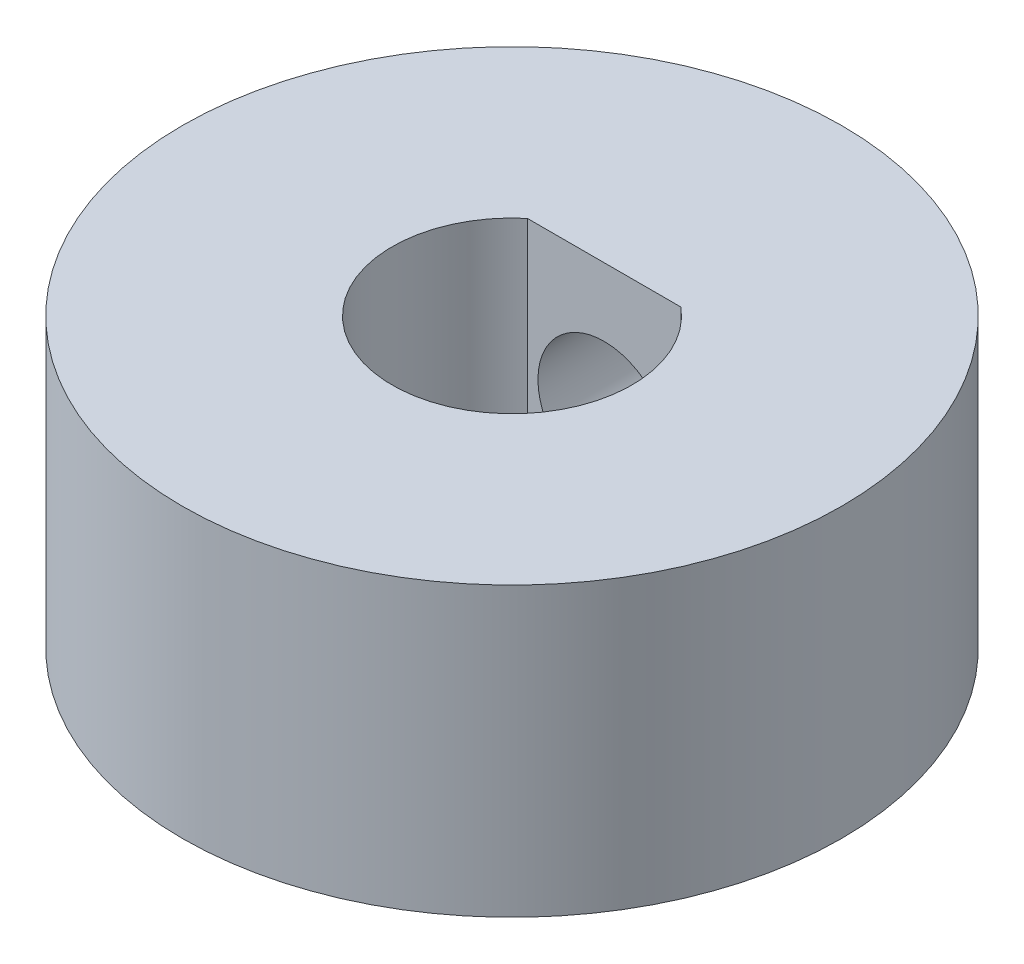
ISO-10303-21;
HEADER;
FILE_DESCRIPTION(('STEP AP214'),'2;1');
FILE_NAME('part.step','',(''),(''),'','','');
FILE_SCHEMA(('AUTOMOTIVE_DESIGN { 1 0 10303 214 1 1 1 1 }'));
ENDSEC;
DATA;
#1=APPLICATION_CONTEXT('core data for automotive mechanical design processes');
#2=APPLICATION_PROTOCOL_DEFINITION('international standard','automotive_design',2000,#1);
#3=PRODUCT_CONTEXT('',#1,'mechanical');
#4=PRODUCT('Part','Part','',(#3));
#5=PRODUCT_RELATED_PRODUCT_CATEGORY('part','',(#4));
#6=PRODUCT_DEFINITION_FORMATION('','',#4);
#7=PRODUCT_DEFINITION_CONTEXT('part definition',#1,'design');
#8=PRODUCT_DEFINITION('design','',#6,#7);
#9=PRODUCT_DEFINITION_SHAPE('','',#8);
#10=(LENGTH_UNIT() NAMED_UNIT(*) SI_UNIT(.MILLI.,.METRE.));
#11=(NAMED_UNIT(*) PLANE_ANGLE_UNIT() SI_UNIT($,.RADIAN.));
#12=(NAMED_UNIT(*) SI_UNIT($,.STERADIAN.) SOLID_ANGLE_UNIT());
#13=UNCERTAINTY_MEASURE_WITH_UNIT(LENGTH_MEASURE(1.E-05),#10,'distance_accuracy_value','');
#14=(GEOMETRIC_REPRESENTATION_CONTEXT(3) GLOBAL_UNCERTAINTY_ASSIGNED_CONTEXT((#13)) GLOBAL_UNIT_ASSIGNED_CONTEXT((#10,
#11,#12)) REPRESENTATION_CONTEXT('',''));
#15=CARTESIAN_POINT('',(0.,0.,0.));
#16=DIRECTION('',(0.,0.,1.));
#17=DIRECTION('',(1.,0.,0.));
#18=AXIS2_PLACEMENT_3D('',#15,#16,#17);
#19=CARTESIAN_POINT('',(0.,7.62,0.));
#20=DIRECTION('',(0.,-1.,0.));
#21=DIRECTION('',(0.,0.,-1.));
#22=AXIS2_PLACEMENT_3D('',#19,#20,#21);
#23=CYLINDRICAL_SURFACE('',#22,3.175);
#24=CARTESIAN_POINT('',(0.,0.,0.));
#25=DIRECTION('',(0.,1.,0.));
#26=DIRECTION('',(0.,0.,1.));
#27=AXIS2_PLACEMENT_3D('',#24,#25,#26);
#28=CIRCLE('',#27,3.175);
#29=CARTESIAN_POINT('',(-2.032,0.,-2.43959033446192));
#30=VERTEX_POINT('',#29);
#31=CARTESIAN_POINT('',(2.032,0.,-2.43959033446192));
#32=VERTEX_POINT('',#31);
#33=EDGE_CURVE('E73',#30,#32,#28,.T.);
#34=ORIENTED_EDGE('',*,*,#33,.F.);
#35=DIRECTION('',(0.,-1.,0.));
#36=VECTOR('',#35,1.);
#37=CARTESIAN_POINT('',(-2.032,7.62,-2.43959033446192));
#38=LINE('',#37,#36);
#39=CARTESIAN_POINT('',(-2.032,7.62,-2.43959033446192));
#40=VERTEX_POINT('',#39);
#41=EDGE_CURVE('E51',#40,#30,#38,.T.);
#42=ORIENTED_EDGE('',*,*,#41,.F.);
#43=CARTESIAN_POINT('',(0.,7.62,0.));
#44=DIRECTION('',(0.,1.,0.));
#45=DIRECTION('',(0.,0.,1.));
#46=AXIS2_PLACEMENT_3D('',#43,#44,#45);
#47=CIRCLE('',#46,3.175);
#48=CARTESIAN_POINT('',(2.032,7.62,-2.43959033446192));
#49=VERTEX_POINT('',#48);
#50=EDGE_CURVE('E74',#40,#49,#47,.T.);
#51=ORIENTED_EDGE('',*,*,#50,.T.);
#52=DIRECTION('',(0.,-1.,0.));
#53=VECTOR('',#52,1.);
#54=CARTESIAN_POINT('',(2.032,7.62,-2.43959033446192));
#55=LINE('',#54,#53);
#56=EDGE_CURVE('E71',#49,#32,#55,.T.);
#57=ORIENTED_EDGE('',*,*,#56,.T.);
#58=EDGE_LOOP('',(#34,#42,#51,#57));
#59=FACE_BOUND('',#58,.T.);
#60=ADVANCED_FACE('F38',(#59),#23,.F.);
#61=CARTESIAN_POINT('',(0.,7.62,-2.43959033446192));
#62=DIRECTION('',(0.,0.,-1.));
#63=DIRECTION('',(-1.,0.,0.));
#64=AXIS2_PLACEMENT_3D('',#61,#62,#63);
#65=PLANE('',#64);
#66=CARTESIAN_POINT('',(0.,4.064,-2.43959033446191));
#67=DIRECTION('',(0.,0.,-1.));
#68=DIRECTION('',(-1.,0.,0.));
#69=AXIS2_PLACEMENT_3D('',#66,#67,#68);
#70=CIRCLE('',#69,1.7526);
#71=CARTESIAN_POINT('',(-1.7526,4.064,-2.43959033446191));
#72=VERTEX_POINT('',#71);
#73=EDGE_CURVE('E87',#72,#72,#70,.F.);
#74=ORIENTED_EDGE('',*,*,#73,.F.);
#75=EDGE_LOOP('',(#74));
#76=FACE_BOUND('',#75,.T.);
#77=DIRECTION('',(1.,0.,0.));
#78=VECTOR('',#77,1.);
#79=CARTESIAN_POINT('',(0.,0.,-2.43959033446192));
#80=LINE('',#79,#78);
#81=EDGE_CURVE('E77',#30,#32,#80,.T.);
#82=ORIENTED_EDGE('',*,*,#81,.T.);
#83=ORIENTED_EDGE('',*,*,#56,.F.);
#84=DIRECTION('',(1.,0.,0.));
#85=VECTOR('',#84,1.);
#86=CARTESIAN_POINT('',(0.,7.62,-2.43959033446192));
#87=LINE('',#86,#85);
#88=EDGE_CURVE('E58',#40,#49,#87,.T.);
#89=ORIENTED_EDGE('',*,*,#88,.F.);
#90=ORIENTED_EDGE('',*,*,#41,.T.);
#91=EDGE_LOOP('',(#82,#83,#89,#90));
#92=FACE_BOUND('',#91,.T.);
#93=ADVANCED_FACE('F78',(#76,#92),#65,.F.);
#94=CARTESIAN_POINT('',(0.,7.62,0.));
#95=DIRECTION('',(0.,-1.,0.));
#96=DIRECTION('',(0.,0.,-1.));
#97=AXIS2_PLACEMENT_3D('',#94,#95,#96);
#98=CYLINDRICAL_SURFACE('',#97,8.73125);
#99=CARTESIAN_POINT('',(0.,6.8326,-8.73125));
#100=CARTESIAN_POINT('',(-0.151472384584233,6.83259935298434,-8.73124947449106));
#101=CARTESIAN_POINT('',(-0.3029520113905,6.82012837544081,-8.72727129269476));
#102=CARTESIAN_POINT('',(-0.601474430383907,6.77070940866285,-8.71179172891819));
#103=CARTESIAN_POINT('',(-0.748516330870155,6.73375653391253,-8.70028884534234));
#104=CARTESIAN_POINT('',(-1.0338156844574,6.63675016258388,-8.67101504432199));
#105=CARTESIAN_POINT('',(-1.17208657407177,6.576733045639,-8.65325400163016));
#106=CARTESIAN_POINT('',(-1.4366017145973,6.43545872542401,-8.61329318281153));
#107=CARTESIAN_POINT('',(-1.56284395859653,6.35419798621246,-8.59109266789175));
#108=CARTESIAN_POINT('',(-1.80372047067413,6.17003289918125,-8.54381798243644));
#109=CARTESIAN_POINT('',(-1.91792010208838,6.06657656530013,-8.51867983669334));
#110=CARTESIAN_POINT('',(-2.12767343767985,5.84213193357004,-8.46872959414002));
#111=CARTESIAN_POINT('',(-2.2232235392977,5.72114025624111,-8.44391756118718));
#112=CARTESIAN_POINT('',(-2.39534876748479,5.46126454367839,-8.39673867205372));
#113=CARTESIAN_POINT('',(-2.47137620234697,5.32200209421514,-8.37445056621347));
#114=CARTESIAN_POINT('',(-2.59874998873783,5.03184701475919,-8.33580756098609));
#115=CARTESIAN_POINT('',(-2.65010306105726,4.88095756473137,-8.31945104625312));
#116=CARTESIAN_POINT('',(-2.72507133844266,4.57674478071945,-8.29519330661295));
#117=CARTESIAN_POINT('',(-2.74949460363218,4.42364072089239,-8.28704643290134));
#118=CARTESIAN_POINT('',(-2.77243486132888,4.11530797622602,-8.27940162413595));
#119=CARTESIAN_POINT('',(-2.77095897618445,3.96007988723457,-8.27990131125003));
#120=CARTESIAN_POINT('',(-2.74277384122496,3.65863343886841,-8.28927666852696));
#121=CARTESIAN_POINT('',(-2.71709756240168,3.51230602485856,-8.2978094371684));
#122=CARTESIAN_POINT('',(-2.64291753019867,3.22615374592841,-8.32173160663915));
#123=CARTESIAN_POINT('',(-2.59441128518325,3.08632959259704,-8.33712175586515));
#124=CARTESIAN_POINT('',(-2.47523037707125,2.81471682139735,-8.37328338181039));
#125=CARTESIAN_POINT('',(-2.40423533028052,2.68307947211083,-8.39413182382158));
#126=CARTESIAN_POINT('',(-2.24231457480099,2.43325025607457,-8.43882633045629));
#127=CARTESIAN_POINT('',(-2.15138356095298,2.3150619809983,-8.46267319226737));
#128=CARTESIAN_POINT('',(-1.94712641847256,2.08965345989879,-8.51204751992886));
#129=CARTESIAN_POINT('',(-1.83294927818404,1.98320868631123,-8.53760132442253));
#130=CARTESIAN_POINT('',(-1.5880475571794,1.79078574495724,-8.58652454816324));
#131=CARTESIAN_POINT('',(-1.4573216781893,1.70480918447965,-8.60989379577812));
#132=CARTESIAN_POINT('',(-1.1815066053666,1.5552168410868,-8.6520728477574));
#133=CARTESIAN_POINT('',(-1.03630805468641,1.49179091316723,-8.67084354454731));
#134=CARTESIAN_POINT('',(-0.736567856371046,1.39049704215195,-8.7014279616364));
#135=CARTESIAN_POINT('',(-0.582029149746095,1.35262109914003,-8.71324385939411));
#136=CARTESIAN_POINT('',(-0.274574060893411,1.30483468402359,-8.72823473184806));
#137=CARTESIAN_POINT('',(-0.121836344071211,1.29387484025335,-8.73173376976));
#138=CARTESIAN_POINT('',(0.183314914836963,1.29726646301027,-8.73065800910595));
#139=CARTESIAN_POINT('',(0.335728502364473,1.31161411017102,-8.72608442884663));
#140=CARTESIAN_POINT('',(0.631824679178514,1.36437346823906,-8.70959051257118));
#141=CARTESIAN_POINT('',(0.775631013443132,1.40215653444254,-8.69786222963305));
#142=CARTESIAN_POINT('',(1.05481947051424,1.49994307731108,-8.66843724040155));
#143=CARTESIAN_POINT('',(1.19020054164173,1.55994932150041,-8.65073979077305));
#144=CARTESIAN_POINT('',(1.4524347312682,1.7021410842905,-8.61064475376114));
#145=CARTESIAN_POINT('',(1.57899276968752,1.78484014831072,-8.588141406858));
#146=CARTESIAN_POINT('',(1.81678475390539,1.9694567459568,-8.54100338427114));
#147=CARTESIAN_POINT('',(1.9280144126383,2.07137963733053,-8.51636811545168));
#148=CARTESIAN_POINT('',(2.1367142462555,2.29648711494163,-8.4664734297526));
#149=CARTESIAN_POINT('',(2.23343617915372,2.42037047486329,-8.44122965963221));
#150=CARTESIAN_POINT('',(2.4047910332809,2.68315731234719,-8.39402366718418));
#151=CARTESIAN_POINT('',(2.47942420498251,2.82206061956828,-8.37206140764768));
#152=CARTESIAN_POINT('',(2.60404062267292,3.11072422716668,-8.33414377062547));
#153=CARTESIAN_POINT('',(2.65411076479825,3.26044407288566,-8.31816726556818));
#154=CARTESIAN_POINT('',(2.72814027283026,3.56680321246625,-8.29418596912205));
#155=CARTESIAN_POINT('',(2.75210995727697,3.72343974638568,-8.28617802755383));
#156=CARTESIAN_POINT('',(2.77250292470933,4.03134505258087,-8.27937538147864));
#157=CARTESIAN_POINT('',(2.77015671446854,4.18252421917552,-8.28016909910884));
#158=CARTESIAN_POINT('',(2.74096747215079,4.48221970476836,-8.2898766597354));
#159=CARTESIAN_POINT('',(2.71412564708891,4.63073615460356,-8.29879010263436));
#160=CARTESIAN_POINT('',(2.63754140234477,4.91861837349535,-8.32344101159602));
#161=CARTESIAN_POINT('',(2.58816103947087,5.05809042121644,-8.33907036972361));
#162=CARTESIAN_POINT('',(2.46818810716033,5.32688036990157,-8.37536170452968));
#163=CARTESIAN_POINT('',(2.39759113260101,5.45619615512055,-8.39602472615923));
#164=CARTESIAN_POINT('',(2.23387835420621,5.70661995387902,-8.44108922352175));
#165=CARTESIAN_POINT('',(2.13997279679889,5.82719059799191,-8.46560741814809));
#166=CARTESIAN_POINT('',(1.93368630683579,6.05126075511337,-8.51509362004053));
#167=CARTESIAN_POINT('',(1.82130037389265,6.15475563256535,-8.54006174741605));
#168=CARTESIAN_POINT('',(1.57665069072115,6.34526205813802,-8.58865246257704));
#169=CARTESIAN_POINT('',(1.44384128482807,6.43159405567302,-8.61220050648618));
#170=CARTESIAN_POINT('',(1.16484980429616,6.58059622072828,-8.65434625576332));
#171=CARTESIAN_POINT('',(1.018672625294,6.64327500791705,-8.67294576373933));
#172=CARTESIAN_POINT('',(0.72856186729587,6.73904703416671,-8.7019271673855));
#173=CARTESIAN_POINT('',(0.585301340574924,6.77402598526938,-8.71282596740998));
#174=CARTESIAN_POINT('',(0.294695565068272,6.82080026865578,-8.72748686535895));
#175=CARTESIAN_POINT('',(0.147351209283364,6.83260062941202,-8.73125051121119));
#176=CARTESIAN_POINT('',(0.,6.8326,-8.73125));
#177=B_SPLINE_CURVE_WITH_KNOTS('',3,(#99,#100,#101,#102,#103,#104,#105,#106,#107,#108,#109,#110,
#111,#112,#113,#114,#115,#116,#117,#118,#119,#120,#121,#122,#123,#124,#125,#126,#127,#128,#129,
#130,#131,#132,#133,#134,#135,#136,#137,#138,#139,#140,#141,#142,#143,#144,#145,#146,#147,#148,
#149,#150,#151,#152,#153,#154,#155,#156,#157,#158,#159,#160,#161,#162,#163,#164,#165,#166,#167,
#168,#169,#170,#171,#172,#173,#174,#175,#176),.UNSPECIFIED.,.T.,.F.,(4,2,2,2,2,2,2,2,2,2,2,2,2,
2,2,2,2,2,2,2,2,2,2,2,2,2,2,2,2,2,2,2,2,2,2,2,2,2,4),(0.,0.453875402871957,0.907841406715232,
1.36109428167842,1.81442264740051,2.28070145331589,2.74707024209938,3.22536463900073,
3.70352868435285,4.16691760762408,4.63017909947097,5.07452138042134,5.51891216761527,
5.96994245980804,6.42109292164611,6.8934249132351,7.3657939829856,7.84205069695993,
8.31815822163036,8.77538643564025,9.23254565139696,9.67794257103017,10.1233949760448,
10.5799040113177,11.0365404657625,11.5118416234337,11.9871373912826,12.4607393666331,
12.9341540403948,13.3855282360861,13.8368801916315,14.2812238524466,14.7256598344222,
15.1879247961639,15.6503150431813,16.1284162822251,16.6063431236748,17.0479655585333,
17.4894921751553),.UNSPECIFIED.);
#178=CARTESIAN_POINT('',(0.,6.8326,-8.73125));
#179=VERTEX_POINT('',#178);
#180=EDGE_CURVE('E11',#179,#179,#177,.T.);
#181=ORIENTED_EDGE('',*,*,#180,.T.);
#182=EDGE_LOOP('',(#181));
#183=FACE_BOUND('',#182,.T.);
#184=CARTESIAN_POINT('',(0.,7.62,0.));
#185=DIRECTION('',(0.,1.,0.));
#186=DIRECTION('',(0.,0.,1.));
#187=AXIS2_PLACEMENT_3D('',#184,#185,#186);
#188=CIRCLE('',#187,8.73125);
#189=CARTESIAN_POINT('',(0.,7.62,8.73125));
#190=VERTEX_POINT('',#189);
#191=EDGE_CURVE('E75',#190,#190,#188,.T.);
#192=ORIENTED_EDGE('',*,*,#191,.F.);
#193=EDGE_LOOP('',(#192));
#194=FACE_BOUND('',#193,.T.);
#195=CARTESIAN_POINT('',(0.,0.,0.));
#196=DIRECTION('',(0.,1.,0.));
#197=DIRECTION('',(0.,0.,1.));
#198=AXIS2_PLACEMENT_3D('',#195,#196,#197);
#199=CIRCLE('',#198,8.73125);
#200=CARTESIAN_POINT('',(0.,0.,8.73125));
#201=VERTEX_POINT('',#200);
#202=EDGE_CURVE('E80',#201,#201,#199,.T.);
#203=ORIENTED_EDGE('',*,*,#202,.T.);
#204=EDGE_LOOP('',(#203));
#205=FACE_BOUND('',#204,.T.);
#206=ADVANCED_FACE('F106',(#183,#194,#205),#98,.T.);
#207=CARTESIAN_POINT('',(0.,7.62,0.));
#208=DIRECTION('',(0.,1.,0.));
#209=DIRECTION('',(0.,0.,1.));
#210=AXIS2_PLACEMENT_3D('',#207,#208,#209);
#211=PLANE('',#210);
#212=ORIENTED_EDGE('',*,*,#50,.F.);
#213=ORIENTED_EDGE('',*,*,#88,.T.);
#214=EDGE_LOOP('',(#212,#213));
#215=FACE_BOUND('',#214,.T.);
#216=ORIENTED_EDGE('',*,*,#191,.T.);
#217=EDGE_LOOP('',(#216));
#218=FACE_BOUND('',#217,.T.);
#219=ADVANCED_FACE('F111',(#215,#218),#211,.T.);
#220=CARTESIAN_POINT('',(0.,0.,0.));
#221=DIRECTION('',(0.,1.,0.));
#222=DIRECTION('',(0.,0.,1.));
#223=AXIS2_PLACEMENT_3D('',#220,#221,#222);
#224=PLANE('',#223);
#225=ORIENTED_EDGE('',*,*,#33,.T.);
#226=ORIENTED_EDGE('',*,*,#81,.F.);
#227=EDGE_LOOP('',(#225,#226));
#228=FACE_BOUND('',#227,.T.);
#229=ORIENTED_EDGE('',*,*,#202,.F.);
#230=EDGE_LOOP('',(#229));
#231=FACE_BOUND('',#230,.T.);
#232=ADVANCED_FACE('F82',(#228,#231),#224,.F.);
#233=CARTESIAN_POINT('',(0.,4.064,-4.92125));
#234=DIRECTION('',(0.,0.,-1.));
#235=DIRECTION('',(-1.,0.,0.));
#236=AXIS2_PLACEMENT_3D('',#233,#234,#235);
#237=CYLINDRICAL_SURFACE('',#236,2.7686);
#238=CARTESIAN_POINT('',(0.,4.064,-4.92125));
#239=DIRECTION('',(0.,0.,-1.));
#240=DIRECTION('',(-1.,0.,0.));
#241=AXIS2_PLACEMENT_3D('',#238,#239,#240);
#242=CIRCLE('',#241,2.7686);
#243=CARTESIAN_POINT('',(-2.7686,4.064,-4.92125));
#244=VERTEX_POINT('',#243);
#245=EDGE_CURVE('E84',#244,#244,#242,.T.);
#246=ORIENTED_EDGE('',*,*,#245,.F.);
#247=EDGE_LOOP('',(#246));
#248=FACE_BOUND('',#247,.T.);
#249=ORIENTED_EDGE('',*,*,#180,.F.);
#250=EDGE_LOOP('',(#249));
#251=FACE_BOUND('',#250,.T.);
#252=ADVANCED_FACE('F117',(#248,#251),#237,.F.);
#253=CARTESIAN_POINT('',(0.,4.064,-4.92125));
#254=DIRECTION('',(0.,0.,-1.));
#255=DIRECTION('',(-1.,0.,0.));
#256=AXIS2_PLACEMENT_3D('',#253,#254,#255);
#257=PLANE('',#256);
#258=CARTESIAN_POINT('',(0.,4.064,-4.92125));
#259=DIRECTION('',(0.,0.,-1.));
#260=DIRECTION('',(-1.,0.,0.));
#261=AXIS2_PLACEMENT_3D('',#258,#259,#260);
#262=CIRCLE('',#261,1.7526);
#263=CARTESIAN_POINT('',(-1.7526,4.064,-4.92125));
#264=VERTEX_POINT('',#263);
#265=EDGE_CURVE('E97',#264,#264,#262,.T.);
#266=ORIENTED_EDGE('',*,*,#265,.F.);
#267=EDGE_LOOP('',(#266));
#268=FACE_BOUND('',#267,.T.);
#269=ORIENTED_EDGE('',*,*,#245,.T.);
#270=EDGE_LOOP('',(#269));
#271=FACE_BOUND('',#270,.T.);
#272=ADVANCED_FACE('F122',(#268,#271),#257,.T.);
#273=CARTESIAN_POINT('',(0.,4.064,8.73225));
#274=DIRECTION('',(0.,0.,-1.));
#275=DIRECTION('',(-1.,0.,0.));
#276=AXIS2_PLACEMENT_3D('',#273,#274,#275);
#277=CYLINDRICAL_SURFACE('',#276,1.7526);
#278=ORIENTED_EDGE('',*,*,#265,.T.);
#279=EDGE_LOOP('',(#278));
#280=FACE_BOUND('',#279,.T.);
#281=ORIENTED_EDGE('',*,*,#73,.T.);
#282=EDGE_LOOP('',(#281));
#283=FACE_BOUND('',#282,.T.);
#284=ADVANCED_FACE('F103',(#280,#283),#277,.F.);
#285=CLOSED_SHELL('',(#60,#93,#206,#219,#232,#252,#272,#284));
#286=MANIFOLD_SOLID_BREP('B2',#285);
#287=ADVANCED_BREP_SHAPE_REPRESENTATION('',(#18,#286),#14);
#288=SHAPE_DEFINITION_REPRESENTATION(#9,#287);
ENDSEC;
END-ISO-10303-21;
